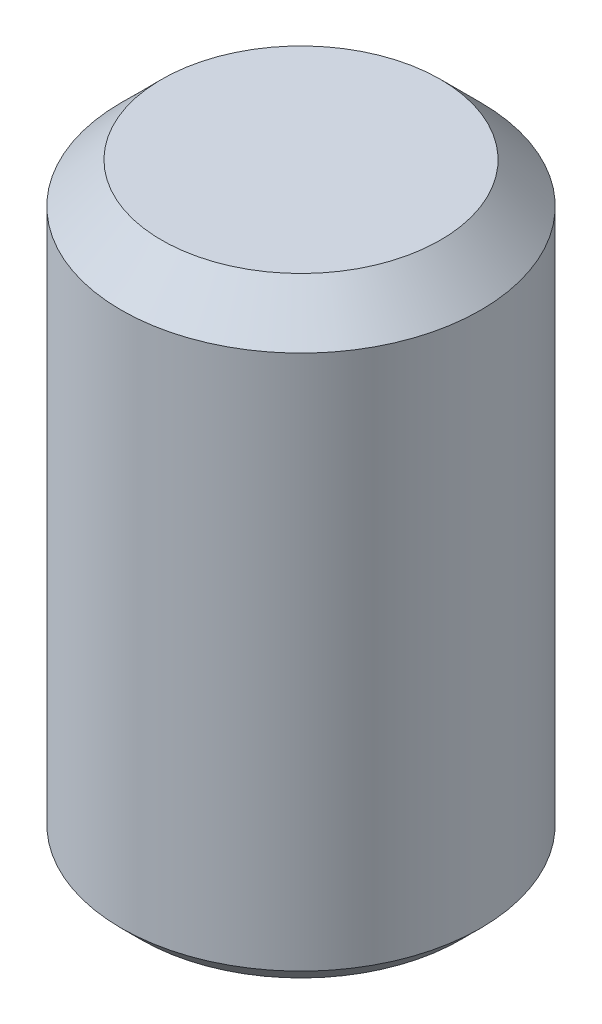
ISO-10303-21;
HEADER;
FILE_DESCRIPTION(('STEP AP214'),'2;1');
FILE_NAME('part.step','',(''),(''),'','','');
FILE_SCHEMA(('AUTOMOTIVE_DESIGN { 1 0 10303 214 1 1 1 1 }'));
ENDSEC;
DATA;
#1=APPLICATION_CONTEXT('core data for automotive mechanical design processes');
#2=APPLICATION_PROTOCOL_DEFINITION('international standard','automotive_design',2000,#1);
#3=PRODUCT_CONTEXT('',#1,'mechanical');
#4=PRODUCT('Part','Part','',(#3));
#5=PRODUCT_RELATED_PRODUCT_CATEGORY('part','',(#4));
#6=PRODUCT_DEFINITION_FORMATION('','',#4);
#7=PRODUCT_DEFINITION_CONTEXT('part definition',#1,'design');
#8=PRODUCT_DEFINITION('design','',#6,#7);
#9=PRODUCT_DEFINITION_SHAPE('','',#8);
#10=(LENGTH_UNIT() NAMED_UNIT(*) SI_UNIT(.MILLI.,.METRE.));
#11=(NAMED_UNIT(*) PLANE_ANGLE_UNIT() SI_UNIT($,.RADIAN.));
#12=(NAMED_UNIT(*) SI_UNIT($,.STERADIAN.) SOLID_ANGLE_UNIT());
#13=UNCERTAINTY_MEASURE_WITH_UNIT(LENGTH_MEASURE(1.E-05),#10,'distance_accuracy_value','');
#14=(GEOMETRIC_REPRESENTATION_CONTEXT(3) GLOBAL_UNCERTAINTY_ASSIGNED_CONTEXT((#13)) GLOBAL_UNIT_ASSIGNED_CONTEXT((#10,
#11,#12)) REPRESENTATION_CONTEXT('',''));
#15=CARTESIAN_POINT('',(0.,0.,0.));
#16=DIRECTION('',(0.,0.,1.));
#17=DIRECTION('',(1.,0.,0.));
#18=AXIS2_PLACEMENT_3D('',#15,#16,#17);
#19=CARTESIAN_POINT('',(0.,0.375,0.));
#20=DIRECTION('',(0.,-1.,0.));
#21=DIRECTION('',(0.,0.,-1.));
#22=AXIS2_PLACEMENT_3D('',#19,#20,#21);
#23=PLANE('',#22);
#24=DIRECTION('',(-0.5,0.,0.866025403784439));
#25=VECTOR('',#24,1.);
#26=CARTESIAN_POINT('',(-0.47,0.375,0.));
#27=LINE('',#26,#25);
#28=CARTESIAN_POINT('',(-0.47,0.375,0.));
#29=VERTEX_POINT('',#28);
#30=CARTESIAN_POINT('',(-0.235,0.375,-0.407031939778686));
#31=VERTEX_POINT('',#30);
#32=EDGE_CURVE('E72',#29,#31,#27,.F.);
#33=ORIENTED_EDGE('',*,*,#32,.T.);
#34=DIRECTION('',(-1.,0.,0.));
#35=VECTOR('',#34,1.);
#36=CARTESIAN_POINT('',(-0.235,0.375,-0.407031939778686));
#37=LINE('',#36,#35);
#38=CARTESIAN_POINT('',(0.235,0.375,-0.407031939778686));
#39=VERTEX_POINT('',#38);
#40=EDGE_CURVE('E69',#31,#39,#37,.F.);
#41=ORIENTED_EDGE('',*,*,#40,.T.);
#42=DIRECTION('',(-0.5,0.,-0.866025403784439));
#43=VECTOR('',#42,1.);
#44=CARTESIAN_POINT('',(0.235,0.375,-0.407031939778686));
#45=LINE('',#44,#43);
#46=CARTESIAN_POINT('',(0.47,0.375,0.));
#47=VERTEX_POINT('',#46);
#48=EDGE_CURVE('E66',#39,#47,#45,.F.);
#49=ORIENTED_EDGE('',*,*,#48,.T.);
#50=DIRECTION('',(0.5,0.,-0.866025403784439));
#51=VECTOR('',#50,1.);
#52=CARTESIAN_POINT('',(0.47,0.375,0.));
#53=LINE('',#52,#51);
#54=CARTESIAN_POINT('',(0.235,0.375,0.407031939778686));
#55=VERTEX_POINT('',#54);
#56=EDGE_CURVE('E89',#47,#55,#53,.F.);
#57=ORIENTED_EDGE('',*,*,#56,.T.);
#58=DIRECTION('',(1.,0.,0.));
#59=VECTOR('',#58,1.);
#60=CARTESIAN_POINT('',(0.235,0.375,0.407031939778686));
#61=LINE('',#60,#59);
#62=CARTESIAN_POINT('',(-0.235,0.375,0.407031939778686));
#63=VERTEX_POINT('',#62);
#64=EDGE_CURVE('E125',#55,#63,#61,.F.);
#65=ORIENTED_EDGE('',*,*,#64,.T.);
#66=DIRECTION('',(0.5,0.,0.866025403784439));
#67=VECTOR('',#66,1.);
#68=CARTESIAN_POINT('',(-0.235,0.375,0.407031939778686));
#69=LINE('',#68,#67);
#70=EDGE_CURVE('E120',#63,#29,#69,.F.);
#71=ORIENTED_EDGE('',*,*,#70,.T.);
#72=EDGE_LOOP('',(#33,#41,#49,#57,#65,#71));
#73=FACE_BOUND('',#72,.T.);
#74=ADVANCED_FACE('F15',(#73),#23,.T.);
#75=CARTESIAN_POINT('',(-0.235,0.,-0.407031939778686));
#76=DIRECTION('',(0.,0.,-1.));
#77=DIRECTION('',(-1.,0.,0.));
#78=AXIS2_PLACEMENT_3D('',#75,#76,#77);
#79=PLANE('',#78);
#80=ORIENTED_EDGE('',*,*,#40,.F.);
#81=DIRECTION('',(0.,1.,0.));
#82=VECTOR('',#81,1.);
#83=CARTESIAN_POINT('',(-0.235,0.,-0.407031939778686));
#84=LINE('',#83,#82);
#85=CARTESIAN_POINT('',(-0.235,0.,-0.407031939778686));
#86=VERTEX_POINT('',#85);
#87=EDGE_CURVE('E114',#31,#86,#84,.F.);
#88=ORIENTED_EDGE('',*,*,#87,.T.);
#89=DIRECTION('',(1.,0.,0.));
#90=VECTOR('',#89,1.);
#91=CARTESIAN_POINT('',(0.,0.,-0.407031939778686));
#92=LINE('',#91,#90);
#93=CARTESIAN_POINT('',(0.235,0.,-0.407031939778686));
#94=VERTEX_POINT('',#93);
#95=EDGE_CURVE('E80',#86,#94,#92,.T.);
#96=ORIENTED_EDGE('',*,*,#95,.T.);
#97=DIRECTION('',(0.,1.,0.));
#98=VECTOR('',#97,1.);
#99=CARTESIAN_POINT('',(0.235,0.,-0.407031939778686));
#100=LINE('',#99,#98);
#101=EDGE_CURVE('E75',#94,#39,#100,.T.);
#102=ORIENTED_EDGE('',*,*,#101,.T.);
#103=EDGE_LOOP('',(#80,#88,#96,#102));
#104=FACE_BOUND('',#103,.T.);
#105=ADVANCED_FACE('F78',(#104),#79,.F.);
#106=CARTESIAN_POINT('',(0.235,0.,-0.407031939778686));
#107=DIRECTION('',(0.866025403784439,0.,-0.5));
#108=DIRECTION('',(-0.5,0.,-0.866025403784439));
#109=AXIS2_PLACEMENT_3D('',#106,#107,#108);
#110=PLANE('',#109);
#111=ORIENTED_EDGE('',*,*,#48,.F.);
#112=ORIENTED_EDGE('',*,*,#101,.F.);
#113=DIRECTION('',(0.5,0.,0.866025403784439));
#114=VECTOR('',#113,1.);
#115=CARTESIAN_POINT('',(0.235,0.,-0.407031939778686));
#116=LINE('',#115,#114);
#117=CARTESIAN_POINT('',(0.47,0.,0.));
#118=VERTEX_POINT('',#117);
#119=EDGE_CURVE('E112',#94,#118,#116,.T.);
#120=ORIENTED_EDGE('',*,*,#119,.T.);
#121=DIRECTION('',(0.,1.,0.));
#122=VECTOR('',#121,1.);
#123=CARTESIAN_POINT('',(0.47,0.,0.));
#124=LINE('',#123,#122);
#125=EDGE_CURVE('E86',#118,#47,#124,.T.);
#126=ORIENTED_EDGE('',*,*,#125,.T.);
#127=EDGE_LOOP('',(#111,#112,#120,#126));
#128=FACE_BOUND('',#127,.T.);
#129=ADVANCED_FACE('F84',(#128),#110,.F.);
#130=CARTESIAN_POINT('',(0.47,0.,0.));
#131=DIRECTION('',(0.866025403784439,0.,0.5));
#132=DIRECTION('',(0.5,0.,-0.866025403784439));
#133=AXIS2_PLACEMENT_3D('',#130,#131,#132);
#134=PLANE('',#133);
#135=ORIENTED_EDGE('',*,*,#56,.F.);
#136=ORIENTED_EDGE('',*,*,#125,.F.);
#137=DIRECTION('',(-0.5,0.,0.866025403784439));
#138=VECTOR('',#137,1.);
#139=CARTESIAN_POINT('',(0.47,0.,0.));
#140=LINE('',#139,#138);
#141=CARTESIAN_POINT('',(0.235,0.,0.407031939778686));
#142=VERTEX_POINT('',#141);
#143=EDGE_CURVE('E110',#118,#142,#140,.T.);
#144=ORIENTED_EDGE('',*,*,#143,.T.);
#145=DIRECTION('',(0.,1.,0.));
#146=VECTOR('',#145,1.);
#147=CARTESIAN_POINT('',(0.235,0.,0.407031939778686));
#148=LINE('',#147,#146);
#149=EDGE_CURVE('E127',#142,#55,#148,.T.);
#150=ORIENTED_EDGE('',*,*,#149,.T.);
#151=EDGE_LOOP('',(#135,#136,#144,#150));
#152=FACE_BOUND('',#151,.T.);
#153=ADVANCED_FACE('F132',(#152),#134,.F.);
#154=CARTESIAN_POINT('',(0.235,0.,0.407031939778686));
#155=DIRECTION('',(0.,0.,1.));
#156=DIRECTION('',(1.,0.,0.));
#157=AXIS2_PLACEMENT_3D('',#154,#155,#156);
#158=PLANE('',#157);
#159=ORIENTED_EDGE('',*,*,#64,.F.);
#160=ORIENTED_EDGE('',*,*,#149,.F.);
#161=DIRECTION('',(1.,0.,0.));
#162=VECTOR('',#161,1.);
#163=CARTESIAN_POINT('',(0.,0.,0.407031939778686));
#164=LINE('',#163,#162);
#165=CARTESIAN_POINT('',(-0.235,0.,0.407031939778686));
#166=VERTEX_POINT('',#165);
#167=EDGE_CURVE('E106',#142,#166,#164,.F.);
#168=ORIENTED_EDGE('',*,*,#167,.T.);
#169=DIRECTION('',(0.,1.,0.));
#170=VECTOR('',#169,1.);
#171=CARTESIAN_POINT('',(-0.235,0.,0.407031939778686));
#172=LINE('',#171,#170);
#173=EDGE_CURVE('E122',#166,#63,#172,.T.);
#174=ORIENTED_EDGE('',*,*,#173,.T.);
#175=EDGE_LOOP('',(#159,#160,#168,#174));
#176=FACE_BOUND('',#175,.T.);
#177=ADVANCED_FACE('F136',(#176),#158,.F.);
#178=CARTESIAN_POINT('',(-0.235,0.,0.407031939778686));
#179=DIRECTION('',(-0.866025403784439,0.,0.5));
#180=DIRECTION('',(0.5,0.,0.866025403784439));
#181=AXIS2_PLACEMENT_3D('',#178,#179,#180);
#182=PLANE('',#181);
#183=ORIENTED_EDGE('',*,*,#70,.F.);
#184=ORIENTED_EDGE('',*,*,#173,.F.);
#185=DIRECTION('',(-0.5,0.,-0.866025403784439));
#186=VECTOR('',#185,1.);
#187=CARTESIAN_POINT('',(-0.235,0.,0.407031939778686));
#188=LINE('',#187,#186);
#189=CARTESIAN_POINT('',(-0.47,0.,0.));
#190=VERTEX_POINT('',#189);
#191=EDGE_CURVE('E33',#166,#190,#188,.T.);
#192=ORIENTED_EDGE('',*,*,#191,.T.);
#193=DIRECTION('',(0.,1.,0.));
#194=VECTOR('',#193,1.);
#195=CARTESIAN_POINT('',(-0.47,0.,0.));
#196=LINE('',#195,#194);
#197=EDGE_CURVE('E118',#190,#29,#196,.T.);
#198=ORIENTED_EDGE('',*,*,#197,.T.);
#199=EDGE_LOOP('',(#183,#184,#192,#198));
#200=FACE_BOUND('',#199,.T.);
#201=ADVANCED_FACE('F138',(#200),#182,.F.);
#202=CARTESIAN_POINT('',(-0.47,0.,0.));
#203=DIRECTION('',(-0.866025403784439,0.,-0.5));
#204=DIRECTION('',(-0.5,0.,0.866025403784439));
#205=AXIS2_PLACEMENT_3D('',#202,#203,#204);
#206=PLANE('',#205);
#207=ORIENTED_EDGE('',*,*,#32,.F.);
#208=ORIENTED_EDGE('',*,*,#197,.F.);
#209=DIRECTION('',(0.5,0.,-0.866025403784439));
#210=VECTOR('',#209,1.);
#211=CARTESIAN_POINT('',(-0.47,0.,0.));
#212=LINE('',#211,#210);
#213=EDGE_CURVE('E99',#190,#86,#212,.T.);
#214=ORIENTED_EDGE('',*,*,#213,.T.);
#215=ORIENTED_EDGE('',*,*,#87,.F.);
#216=EDGE_LOOP('',(#207,#208,#214,#215));
#217=FACE_BOUND('',#216,.T.);
#218=ADVANCED_FACE('F139',(#217),#206,.F.);
#219=CARTESIAN_POINT('',(0.,2.95,0.));
#220=DIRECTION('',(0.,1.,0.));
#221=DIRECTION('',(0.,0.,1.));
#222=AXIS2_PLACEMENT_3D('',#219,#220,#221);
#223=PLANE('',#222);
#224=CARTESIAN_POINT('',(0.,2.94999999994161,0.));
#225=DIRECTION('',(0.,-1.,0.));
#226=DIRECTION('',(0.,0.,-1.));
#227=AXIS2_PLACEMENT_3D('',#224,#225,#226);
#228=CIRCLE('',#227,0.690000000076906);
#229=CARTESIAN_POINT('',(0.,2.94999999994161,-0.690000000076907));
#230=VERTEX_POINT('',#229);
#231=EDGE_CURVE('E18',#230,#230,#228,.T.);
#232=ORIENTED_EDGE('',*,*,#231,.F.);
#233=EDGE_LOOP('',(#232));
#234=FACE_BOUND('',#233,.T.);
#235=ADVANCED_FACE('F141',(#234),#223,.T.);
#236=CARTESIAN_POINT('',(0.,0.,0.));
#237=DIRECTION('',(0.,1.,0.));
#238=DIRECTION('',(0.,0.,1.));
#239=AXIS2_PLACEMENT_3D('',#236,#237,#238);
#240=PLANE('',#239);
#241=ORIENTED_EDGE('',*,*,#191,.F.);
#242=ORIENTED_EDGE('',*,*,#167,.F.);
#243=ORIENTED_EDGE('',*,*,#143,.F.);
#244=ORIENTED_EDGE('',*,*,#119,.F.);
#245=ORIENTED_EDGE('',*,*,#95,.F.);
#246=ORIENTED_EDGE('',*,*,#213,.F.);
#247=EDGE_LOOP('',(#241,#242,#243,#244,#245,#246));
#248=FACE_BOUND('',#247,.T.);
#249=CARTESIAN_POINT('',(0.,-5.6843418860808E-11,0.));
#250=DIRECTION('',(0.,1.,0.));
#251=DIRECTION('',(0.,0.,1.));
#252=AXIS2_PLACEMENT_3D('',#249,#250,#251);
#253=CIRCLE('',#252,0.789999999994961);
#254=CARTESIAN_POINT('',(0.,-5.6843418860808E-11,0.78999999999496));
#255=VERTEX_POINT('',#254);
#256=EDGE_CURVE('E92',#255,#255,#253,.T.);
#257=ORIENTED_EDGE('',*,*,#256,.F.);
#258=EDGE_LOOP('',(#257));
#259=FACE_BOUND('',#258,.T.);
#260=ADVANCED_FACE('F148',(#248,#259),#240,.F.);
#261=CARTESIAN_POINT('',(0.,2.7500000001055,0.));
#262=DIRECTION('',(0.,-1.,0.));
#263=DIRECTION('',(0.,0.,-1.));
#264=AXIS2_PLACEMENT_3D('',#261,#262,#263);
#265=CONICAL_SURFACE('',#264,0.889999999913015,0.785398163397448);
#266=CARTESIAN_POINT('',(0.,2.75,0.));
#267=DIRECTION('',(0.,1.,0.));
#268=DIRECTION('',(0.,0.,1.));
#269=AXIS2_PLACEMENT_3D('',#266,#267,#268);
#270=CIRCLE('',#269,0.89);
#271=CARTESIAN_POINT('',(0.,2.75,0.89));
#272=VERTEX_POINT('',#271);
#273=EDGE_CURVE('E24',#272,#272,#270,.F.);
#274=ORIENTED_EDGE('',*,*,#273,.F.);
#275=EDGE_LOOP('',(#274));
#276=FACE_BOUND('',#275,.T.);
#277=ORIENTED_EDGE('',*,*,#231,.T.);
#278=EDGE_LOOP('',(#277));
#279=FACE_BOUND('',#278,.T.);
#280=ADVANCED_FACE('F160',(#276,#279),#265,.T.);
#281=CARTESIAN_POINT('',(0.,0.0999999998612111,0.));
#282=DIRECTION('',(0.,1.,0.));
#283=DIRECTION('',(0.,0.,1.));
#284=AXIS2_PLACEMENT_3D('',#281,#282,#283);
#285=CONICAL_SURFACE('',#284,0.889999999913015,0.785398163397448);
#286=CARTESIAN_POINT('',(0.,0.1,0.));
#287=DIRECTION('',(0.,1.,0.));
#288=DIRECTION('',(0.,0.,1.));
#289=AXIS2_PLACEMENT_3D('',#286,#287,#288);
#290=CIRCLE('',#289,0.89);
#291=CARTESIAN_POINT('',(0.,0.1,0.89));
#292=VERTEX_POINT('',#291);
#293=EDGE_CURVE('E10',#292,#292,#290,.T.);
#294=ORIENTED_EDGE('',*,*,#293,.F.);
#295=EDGE_LOOP('',(#294));
#296=FACE_BOUND('',#295,.T.);
#297=ORIENTED_EDGE('',*,*,#256,.T.);
#298=EDGE_LOOP('',(#297));
#299=FACE_BOUND('',#298,.T.);
#300=ADVANCED_FACE('F154',(#296,#299),#285,.T.);
#301=CARTESIAN_POINT('',(0.,0.,0.));
#302=DIRECTION('',(0.,1.,0.));
#303=DIRECTION('',(0.,0.,1.));
#304=AXIS2_PLACEMENT_3D('',#301,#302,#303);
#305=CYLINDRICAL_SURFACE('',#304,0.89);
#306=ORIENTED_EDGE('',*,*,#273,.T.);
#307=EDGE_LOOP('',(#306));
#308=FACE_BOUND('',#307,.T.);
#309=ORIENTED_EDGE('',*,*,#293,.T.);
#310=EDGE_LOOP('',(#309));
#311=FACE_BOUND('',#310,.T.);
#312=ADVANCED_FACE('F152',(#308,#311),#305,.T.);
#313=CLOSED_SHELL('',(#74,#105,#129,#153,#177,#201,#218,#235,#260,#280,#300,#312));
#314=MANIFOLD_SOLID_BREP('B1',#313);
#315=ADVANCED_BREP_SHAPE_REPRESENTATION('',(#18,#314),#14);
#316=SHAPE_DEFINITION_REPRESENTATION(#9,#315);
ENDSEC;
END-ISO-10303-21;
